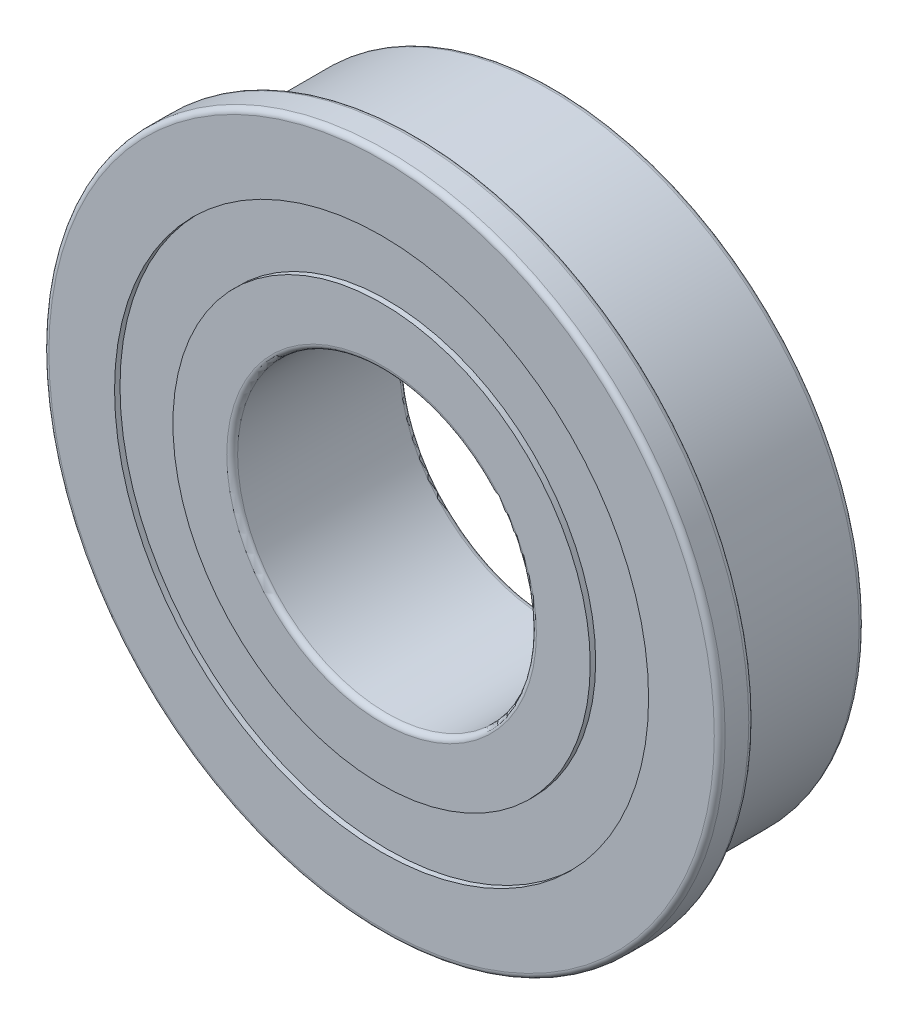
ISO-10303-21;
HEADER;
FILE_DESCRIPTION(('STEP AP214'),'2;1');
FILE_NAME('part.step','',(''),(''),'','','');
FILE_SCHEMA(('AUTOMOTIVE_DESIGN { 1 0 10303 214 1 1 1 1 }'));
ENDSEC;
DATA;
#1=APPLICATION_CONTEXT('core data for automotive mechanical design processes');
#2=APPLICATION_PROTOCOL_DEFINITION('international standard','automotive_design',2000,#1);
#3=PRODUCT_CONTEXT('',#1,'mechanical');
#4=PRODUCT('Part','Part','',(#3));
#5=PRODUCT_RELATED_PRODUCT_CATEGORY('part','',(#4));
#6=PRODUCT_DEFINITION_FORMATION('','',#4);
#7=PRODUCT_DEFINITION_CONTEXT('part definition',#1,'design');
#8=PRODUCT_DEFINITION('design','',#6,#7);
#9=PRODUCT_DEFINITION_SHAPE('','',#8);
#10=(LENGTH_UNIT() NAMED_UNIT(*) SI_UNIT(.MILLI.,.METRE.));
#11=(NAMED_UNIT(*) PLANE_ANGLE_UNIT() SI_UNIT($,.RADIAN.));
#12=(NAMED_UNIT(*) SI_UNIT($,.STERADIAN.) SOLID_ANGLE_UNIT());
#13=UNCERTAINTY_MEASURE_WITH_UNIT(LENGTH_MEASURE(1.E-05),#10,'distance_accuracy_value','');
#14=(GEOMETRIC_REPRESENTATION_CONTEXT(3) GLOBAL_UNCERTAINTY_ASSIGNED_CONTEXT((#13)) GLOBAL_UNIT_ASSIGNED_CONTEXT((#10,
#11,#12)) REPRESENTATION_CONTEXT('',''));
#15=CARTESIAN_POINT('',(0.,0.,0.));
#16=DIRECTION('',(0.,0.,1.));
#17=DIRECTION('',(1.,0.,0.));
#18=AXIS2_PLACEMENT_3D('',#15,#16,#17);
#19=CARTESIAN_POINT('',(0.,0.,53.2489151398073));
#20=DIRECTION('',(0.,0.,1.));
#21=DIRECTION('',(1.,0.,0.));
#22=AXIS2_PLACEMENT_3D('',#19,#20,#21);
#23=CYLINDRICAL_SURFACE('',#22,12.2875);
#24=CARTESIAN_POINT('',(0.,0.,-3.96875));
#25=DIRECTION('',(0.,0.,1.));
#26=DIRECTION('',(1.,0.,0.));
#27=AXIS2_PLACEMENT_3D('',#24,#25,#26);
#28=CIRCLE('',#27,12.2875);
#29=CARTESIAN_POINT('',(12.2875,0.,-3.96875));
#30=VERTEX_POINT('',#29);
#31=EDGE_CURVE('E405',#30,#30,#28,.F.);
#32=ORIENTED_EDGE('',*,*,#31,.T.);
#33=EDGE_LOOP('',(#32));
#34=FACE_BOUND('',#33,.T.);
#35=CARTESIAN_POINT('',(0.,0.,-3.71875));
#36=DIRECTION('',(0.,0.,1.));
#37=DIRECTION('',(1.,0.,0.));
#38=AXIS2_PLACEMENT_3D('',#35,#36,#37);
#39=CIRCLE('',#38,12.2875);
#40=CARTESIAN_POINT('',(12.2875,0.,-3.71875));
#41=VERTEX_POINT('',#40);
#42=EDGE_CURVE('E78',#41,#41,#39,.T.);
#43=ORIENTED_EDGE('',*,*,#42,.T.);
#44=EDGE_LOOP('',(#43));
#45=FACE_BOUND('',#44,.T.);
#46=ADVANCED_FACE('F15',(#34,#45),#23,.F.);
#47=CARTESIAN_POINT('',(0.,12.2875,-3.96875));
#48=DIRECTION('',(0.,0.,1.));
#49=DIRECTION('',(1.,0.,0.));
#50=AXIS2_PLACEMENT_3D('',#47,#48,#49);
#51=PLANE('',#50);
#52=ORIENTED_EDGE('',*,*,#31,.F.);
#53=EDGE_LOOP('',(#52));
#54=FACE_BOUND('',#53,.T.);
#55=CARTESIAN_POINT('',(0.,0.,-3.96875));
#56=DIRECTION('',(0.,0.,1.));
#57=DIRECTION('',(1.,0.,0.));
#58=AXIS2_PLACEMENT_3D('',#55,#56,#57);
#59=CIRCLE('',#58,14.0375);
#60=CARTESIAN_POINT('',(14.0375,0.,-3.96875));
#61=VERTEX_POINT('',#60);
#62=CARTESIAN_POINT('',(-14.0375,0.,-3.96875));
#63=VERTEX_POINT('',#62);
#64=EDGE_CURVE('E68',#61,#63,#59,.T.);
#65=ORIENTED_EDGE('',*,*,#64,.F.);
#66=CARTESIAN_POINT('',(0.,0.,-3.96875));
#67=DIRECTION('',(0.,0.,1.));
#68=DIRECTION('',(-1.,0.,0.));
#69=AXIS2_PLACEMENT_3D('',#66,#67,#68);
#70=CIRCLE('',#69,14.0375);
#71=EDGE_CURVE('E66',#63,#61,#70,.T.);
#72=ORIENTED_EDGE('',*,*,#71,.F.);
#73=EDGE_LOOP('',(#65,#72));
#74=FACE_BOUND('',#73,.T.);
#75=ADVANCED_FACE('F77',(#54,#74),#51,.F.);
#76=CARTESIAN_POINT('',(0.,9.602,-3.71875));
#77=DIRECTION('',(0.,0.,1.));
#78=DIRECTION('',(1.,0.,0.));
#79=AXIS2_PLACEMENT_3D('',#76,#77,#78);
#80=PLANE('',#79);
#81=CARTESIAN_POINT('',(0.,0.,-3.71875));
#82=DIRECTION('',(0.,0.,1.));
#83=DIRECTION('',(1.,0.,0.));
#84=AXIS2_PLACEMENT_3D('',#81,#82,#83);
#85=CIRCLE('',#84,9.602);
#86=CARTESIAN_POINT('',(9.602,0.,-3.71875));
#87=VERTEX_POINT('',#86);
#88=EDGE_CURVE('E73',#87,#87,#85,.F.);
#89=ORIENTED_EDGE('',*,*,#88,.F.);
#90=EDGE_LOOP('',(#89));
#91=FACE_BOUND('',#90,.T.);
#92=ORIENTED_EDGE('',*,*,#42,.F.);
#93=EDGE_LOOP('',(#92));
#94=FACE_BOUND('',#93,.T.);
#95=ADVANCED_FACE('F92',(#91,#94),#80,.F.);
#96=CARTESIAN_POINT('',(0.,0.,-3.71875));
#97=DIRECTION('',(0.,0.,1.));
#98=DIRECTION('',(1.,0.,0.));
#99=AXIS2_PLACEMENT_3D('',#96,#97,#98);
#100=TOROIDAL_SURFACE('',#99,14.0375,0.25);
#101=CARTESIAN_POINT('',(0.,0.,-3.71875));
#102=DIRECTION('',(0.,0.,1.));
#103=DIRECTION('',(1.,0.,0.));
#104=AXIS2_PLACEMENT_3D('',#101,#102,#103);
#105=CIRCLE('',#104,14.2875);
#106=CARTESIAN_POINT('',(14.2875,0.,-3.71875));
#107=VERTEX_POINT('',#106);
#108=EDGE_CURVE('E107',#107,#107,#105,.T.);
#109=ORIENTED_EDGE('',*,*,#108,.F.);
#110=EDGE_LOOP('',(#109));
#111=FACE_BOUND('',#110,.T.);
#112=ORIENTED_EDGE('',*,*,#64,.T.);
#113=ORIENTED_EDGE('',*,*,#71,.T.);
#114=EDGE_LOOP('',(#112,#113));
#115=FACE_BOUND('',#114,.T.);
#116=ADVANCED_FACE('F70',(#111,#115),#100,.T.);
#117=CARTESIAN_POINT('',(0.,0.,53.2489151398073));
#118=DIRECTION('',(0.,0.,1.));
#119=DIRECTION('',(1.,0.,0.));
#120=AXIS2_PLACEMENT_3D('',#117,#118,#119);
#121=CYLINDRICAL_SURFACE('',#120,9.602);
#122=ORIENTED_EDGE('',*,*,#88,.T.);
#123=EDGE_LOOP('',(#122));
#124=FACE_BOUND('',#123,.T.);
#125=CARTESIAN_POINT('',(0.,0.,-3.96875));
#126=DIRECTION('',(0.,0.,1.));
#127=DIRECTION('',(1.,0.,0.));
#128=AXIS2_PLACEMENT_3D('',#125,#126,#127);
#129=CIRCLE('',#128,9.602);
#130=CARTESIAN_POINT('',(9.602,0.,-3.96875));
#131=VERTEX_POINT('',#130);
#132=EDGE_CURVE('E110',#131,#131,#129,.T.);
#133=ORIENTED_EDGE('',*,*,#132,.T.);
#134=EDGE_LOOP('',(#133));
#135=FACE_BOUND('',#134,.T.);
#136=ADVANCED_FACE('F101',(#124,#135),#121,.T.);
#137=CARTESIAN_POINT('',(0.,0.,53.2489151398073));
#138=DIRECTION('',(0.,0.,1.));
#139=DIRECTION('',(1.,0.,0.));
#140=AXIS2_PLACEMENT_3D('',#137,#138,#139);
#141=CYLINDRICAL_SURFACE('',#140,14.2875);
#142=CARTESIAN_POINT('',(0.,0.,1.63125));
#143=DIRECTION('',(0.,0.,-1.));
#144=DIRECTION('',(-1.,0.,0.));
#145=AXIS2_PLACEMENT_3D('',#142,#143,#144);
#146=CIRCLE('',#145,14.2875);
#147=CARTESIAN_POINT('',(-14.2875,0.,1.63125));
#148=VERTEX_POINT('',#147);
#149=EDGE_CURVE('E111',#148,#148,#146,.F.);
#150=ORIENTED_EDGE('',*,*,#149,.F.);
#151=EDGE_LOOP('',(#150));
#152=FACE_BOUND('',#151,.T.);
#153=ORIENTED_EDGE('',*,*,#108,.T.);
#154=EDGE_LOOP('',(#153));
#155=FACE_BOUND('',#154,.T.);
#156=ADVANCED_FACE('F161',(#152,#155),#141,.T.);
#157=CARTESIAN_POINT('',(0.,6.875,-3.96875));
#158=DIRECTION('',(0.,0.,1.));
#159=DIRECTION('',(1.,0.,0.));
#160=AXIS2_PLACEMENT_3D('',#157,#158,#159);
#161=PLANE('',#160);
#162=ORIENTED_EDGE('',*,*,#132,.F.);
#163=EDGE_LOOP('',(#162));
#164=FACE_BOUND('',#163,.T.);
#165=CARTESIAN_POINT('',(0.,0.,-3.96875));
#166=DIRECTION('',(0.,0.,-1.));
#167=DIRECTION('',(1.,0.,0.));
#168=AXIS2_PLACEMENT_3D('',#165,#166,#167);
#169=CIRCLE('',#168,7.125);
#170=CARTESIAN_POINT('',(7.125,0.,-3.96875));
#171=VERTEX_POINT('',#170);
#172=CARTESIAN_POINT('',(-7.125,0.,-3.96875));
#173=VERTEX_POINT('',#172);
#174=EDGE_CURVE('E114',#171,#173,#169,.T.);
#175=ORIENTED_EDGE('',*,*,#174,.F.);
#176=CARTESIAN_POINT('',(0.,0.,-3.96875));
#177=DIRECTION('',(0.,0.,-1.));
#178=DIRECTION('',(-1.,0.,0.));
#179=AXIS2_PLACEMENT_3D('',#176,#177,#178);
#180=CIRCLE('',#179,7.125);
#181=EDGE_CURVE('E145',#173,#171,#180,.T.);
#182=ORIENTED_EDGE('',*,*,#181,.F.);
#183=EDGE_LOOP('',(#175,#182));
#184=FACE_BOUND('',#183,.T.);
#185=ADVANCED_FACE('F153',(#164,#184),#161,.F.);
#186=CARTESIAN_POINT('',(0.,0.,1.63125));
#187=DIRECTION('',(0.,0.,-1.));
#188=DIRECTION('',(-1.,0.,0.));
#189=AXIS2_PLACEMENT_3D('',#186,#187,#188);
#190=CONICAL_SURFACE('',#189,14.2875,0.523598775598298);
#191=ORIENTED_EDGE('',*,*,#149,.T.);
#192=EDGE_LOOP('',(#191));
#193=FACE_BOUND('',#192,.T.);
#194=CARTESIAN_POINT('',(0.,0.,2.00625));
#195=DIRECTION('',(0.,0.,1.));
#196=DIRECTION('',(1.,0.,0.));
#197=AXIS2_PLACEMENT_3D('',#194,#195,#196);
#198=CIRCLE('',#197,14.0709936490539);
#199=CARTESIAN_POINT('',(14.0709936490539,0.,2.00625));
#200=VERTEX_POINT('',#199);
#201=EDGE_CURVE('E142',#200,#200,#198,.F.);
#202=ORIENTED_EDGE('',*,*,#201,.T.);
#203=EDGE_LOOP('',(#202));
#204=FACE_BOUND('',#203,.T.);
#205=ADVANCED_FACE('F132',(#193,#204),#190,.T.);
#206=CARTESIAN_POINT('',(0.,0.,-3.71875));
#207=DIRECTION('',(0.,0.,1.));
#208=DIRECTION('',(1.,0.,0.));
#209=AXIS2_PLACEMENT_3D('',#206,#207,#208);
#210=TOROIDAL_SURFACE('',#209,7.125,0.25);
#211=ORIENTED_EDGE('',*,*,#174,.T.);
#212=ORIENTED_EDGE('',*,*,#181,.T.);
#213=EDGE_LOOP('',(#211,#212));
#214=FACE_BOUND('',#213,.T.);
#215=CARTESIAN_POINT('',(0.,0.,-3.71875));
#216=DIRECTION('',(0.,0.,1.));
#217=DIRECTION('',(1.,0.,0.));
#218=AXIS2_PLACEMENT_3D('',#215,#216,#217);
#219=CIRCLE('',#218,6.875);
#220=CARTESIAN_POINT('',(6.875,0.,-3.71875));
#221=VERTEX_POINT('',#220);
#222=EDGE_CURVE('E140',#221,#221,#219,.T.);
#223=ORIENTED_EDGE('',*,*,#222,.T.);
#224=EDGE_LOOP('',(#223));
#225=FACE_BOUND('',#224,.T.);
#226=ADVANCED_FACE('F120',(#214,#225),#210,.T.);
#227=CARTESIAN_POINT('',(0.,0.,53.2489151398073));
#228=DIRECTION('',(0.,0.,1.));
#229=DIRECTION('',(1.,0.,0.));
#230=AXIS2_PLACEMENT_3D('',#227,#228,#229);
#231=CYLINDRICAL_SURFACE('',#230,6.875);
#232=ORIENTED_EDGE('',*,*,#222,.F.);
#233=EDGE_LOOP('',(#232));
#234=FACE_BOUND('',#233,.T.);
#235=CARTESIAN_POINT('',(0.,0.,3.71875));
#236=DIRECTION('',(0.,0.,-1.));
#237=DIRECTION('',(-1.,0.,0.));
#238=AXIS2_PLACEMENT_3D('',#235,#236,#237);
#239=CIRCLE('',#238,6.875);
#240=CARTESIAN_POINT('',(-6.875,0.,3.71875));
#241=VERTEX_POINT('',#240);
#242=EDGE_CURVE('E384',#241,#241,#239,.T.);
#243=ORIENTED_EDGE('',*,*,#242,.F.);
#244=EDGE_LOOP('',(#243));
#245=FACE_BOUND('',#244,.T.);
#246=ADVANCED_FACE('F131',(#234,#245),#231,.F.);
#247=CARTESIAN_POINT('',(0.,0.,2.13125));
#248=DIRECTION('',(0.,0.,1.));
#249=DIRECTION('',(1.,0.,0.));
#250=AXIS2_PLACEMENT_3D('',#247,#248,#249);
#251=TOROIDAL_SURFACE('',#250,14.2875,0.249999999999998);
#252=ORIENTED_EDGE('',*,*,#201,.F.);
#253=EDGE_LOOP('',(#252));
#254=FACE_BOUND('',#253,.T.);
#255=CARTESIAN_POINT('',(0.,0.,2.38125));
#256=DIRECTION('',(0.,0.,-1.));
#257=DIRECTION('',(1.,0.,0.));
#258=AXIS2_PLACEMENT_3D('',#255,#256,#257);
#259=CIRCLE('',#258,14.2875);
#260=CARTESIAN_POINT('',(14.2875,0.,2.38125));
#261=VERTEX_POINT('',#260);
#262=CARTESIAN_POINT('',(-14.2875,0.,2.38125));
#263=VERTEX_POINT('',#262);
#264=EDGE_CURVE('E386',#261,#263,#259,.T.);
#265=ORIENTED_EDGE('',*,*,#264,.T.);
#266=CARTESIAN_POINT('',(0.,0.,2.38125));
#267=DIRECTION('',(0.,0.,-1.));
#268=DIRECTION('',(-1.,0.,0.));
#269=AXIS2_PLACEMENT_3D('',#266,#267,#268);
#270=CIRCLE('',#269,14.2875);
#271=EDGE_CURVE('E322',#263,#261,#270,.T.);
#272=ORIENTED_EDGE('',*,*,#271,.T.);
#273=EDGE_LOOP('',(#265,#272));
#274=FACE_BOUND('',#273,.T.);
#275=ADVANCED_FACE('F355',(#254,#274),#251,.F.);
#276=CARTESIAN_POINT('',(0.,0.,3.71875));
#277=DIRECTION('',(0.,0.,-1.));
#278=DIRECTION('',(-1.,0.,0.));
#279=AXIS2_PLACEMENT_3D('',#276,#277,#278);
#280=TOROIDAL_SURFACE('',#279,7.125,0.25);
#281=CARTESIAN_POINT('',(0.,0.,3.96875));
#282=DIRECTION('',(0.,0.,1.));
#283=DIRECTION('',(-1.,0.,0.));
#284=AXIS2_PLACEMENT_3D('',#281,#282,#283);
#285=CIRCLE('',#284,7.125);
#286=CARTESIAN_POINT('',(-7.125,0.,3.96875));
#287=VERTEX_POINT('',#286);
#288=CARTESIAN_POINT('',(7.125,0.,3.96875));
#289=VERTEX_POINT('',#288);
#290=EDGE_CURVE('E266',#287,#289,#285,.T.);
#291=ORIENTED_EDGE('',*,*,#290,.T.);
#292=CARTESIAN_POINT('',(0.,0.,3.96875));
#293=DIRECTION('',(0.,0.,1.));
#294=DIRECTION('',(1.,0.,0.));
#295=AXIS2_PLACEMENT_3D('',#292,#293,#294);
#296=CIRCLE('',#295,7.125);
#297=EDGE_CURVE('E277',#289,#287,#296,.T.);
#298=ORIENTED_EDGE('',*,*,#297,.T.);
#299=EDGE_LOOP('',(#291,#298));
#300=FACE_BOUND('',#299,.T.);
#301=ORIENTED_EDGE('',*,*,#242,.T.);
#302=EDGE_LOOP('',(#301));
#303=FACE_BOUND('',#302,.T.);
#304=ADVANCED_FACE('F301',(#300,#303),#280,.T.);
#305=CARTESIAN_POINT('',(0.,14.2875,2.38125));
#306=DIRECTION('',(0.,0.,1.));
#307=DIRECTION('',(1.,0.,0.));
#308=AXIS2_PLACEMENT_3D('',#305,#306,#307);
#309=PLANE('',#308);
#310=ORIENTED_EDGE('',*,*,#264,.F.);
#311=ORIENTED_EDGE('',*,*,#271,.F.);
#312=EDGE_LOOP('',(#310,#311));
#313=FACE_BOUND('',#312,.T.);
#314=CARTESIAN_POINT('',(0.,0.,2.38125));
#315=DIRECTION('',(0.,0.,1.));
#316=DIRECTION('',(1.,0.,0.));
#317=AXIS2_PLACEMENT_3D('',#314,#315,#316);
#318=CIRCLE('',#317,15.31);
#319=CARTESIAN_POINT('',(15.31,0.,2.38125));
#320=VERTEX_POINT('',#319);
#321=CARTESIAN_POINT('',(-15.31,0.,2.38125));
#322=VERTEX_POINT('',#321);
#323=EDGE_CURVE('E235',#320,#322,#318,.T.);
#324=ORIENTED_EDGE('',*,*,#323,.F.);
#325=CARTESIAN_POINT('',(0.,0.,2.38125));
#326=DIRECTION('',(0.,0.,1.));
#327=DIRECTION('',(-1.,0.,0.));
#328=AXIS2_PLACEMENT_3D('',#325,#326,#327);
#329=CIRCLE('',#328,15.31);
#330=EDGE_CURVE('E332',#322,#320,#329,.T.);
#331=ORIENTED_EDGE('',*,*,#330,.F.);
#332=EDGE_LOOP('',(#324,#331));
#333=FACE_BOUND('',#332,.T.);
#334=ADVANCED_FACE('F292',(#313,#333),#309,.F.);
#335=CARTESIAN_POINT('',(0.,9.602,3.96875));
#336=DIRECTION('',(0.,0.,-1.));
#337=DIRECTION('',(-1.,0.,0.));
#338=AXIS2_PLACEMENT_3D('',#335,#336,#337);
#339=PLANE('',#338);
#340=CARTESIAN_POINT('',(0.,0.,3.96875));
#341=DIRECTION('',(0.,0.,1.));
#342=DIRECTION('',(1.,0.,0.));
#343=AXIS2_PLACEMENT_3D('',#340,#341,#342);
#344=CIRCLE('',#343,9.602);
#345=CARTESIAN_POINT('',(9.602,0.,3.96875));
#346=VERTEX_POINT('',#345);
#347=EDGE_CURVE('E390',#346,#346,#344,.F.);
#348=ORIENTED_EDGE('',*,*,#347,.F.);
#349=EDGE_LOOP('',(#348));
#350=FACE_BOUND('',#349,.T.);
#351=ORIENTED_EDGE('',*,*,#290,.F.);
#352=ORIENTED_EDGE('',*,*,#297,.F.);
#353=EDGE_LOOP('',(#351,#352));
#354=FACE_BOUND('',#353,.T.);
#355=ADVANCED_FACE('F255',(#350,#354),#339,.F.);
#356=CARTESIAN_POINT('',(0.,0.,2.63125));
#357=DIRECTION('',(0.,0.,1.));
#358=DIRECTION('',(1.,0.,0.));
#359=AXIS2_PLACEMENT_3D('',#356,#357,#358);
#360=TOROIDAL_SURFACE('',#359,15.31,0.25);
#361=ORIENTED_EDGE('',*,*,#323,.T.);
#362=ORIENTED_EDGE('',*,*,#330,.T.);
#363=EDGE_LOOP('',(#361,#362));
#364=FACE_BOUND('',#363,.T.);
#365=CARTESIAN_POINT('',(0.,0.,2.63125));
#366=DIRECTION('',(0.,0.,1.));
#367=DIRECTION('',(1.,0.,0.));
#368=AXIS2_PLACEMENT_3D('',#365,#366,#367);
#369=CIRCLE('',#368,15.56);
#370=CARTESIAN_POINT('',(15.56,0.,2.63125));
#371=VERTEX_POINT('',#370);
#372=EDGE_CURVE('E263',#371,#371,#369,.T.);
#373=ORIENTED_EDGE('',*,*,#372,.F.);
#374=EDGE_LOOP('',(#373));
#375=FACE_BOUND('',#374,.T.);
#376=ADVANCED_FACE('F243',(#364,#375),#360,.T.);
#377=CARTESIAN_POINT('',(0.,0.,53.2489151398073));
#378=DIRECTION('',(0.,0.,1.));
#379=DIRECTION('',(1.,0.,0.));
#380=AXIS2_PLACEMENT_3D('',#377,#378,#379);
#381=CYLINDRICAL_SURFACE('',#380,9.602);
#382=ORIENTED_EDGE('',*,*,#347,.T.);
#383=EDGE_LOOP('',(#382));
#384=FACE_BOUND('',#383,.T.);
#385=CARTESIAN_POINT('',(0.,0.,3.71875));
#386=DIRECTION('',(0.,0.,1.));
#387=DIRECTION('',(1.,0.,0.));
#388=AXIS2_PLACEMENT_3D('',#385,#386,#387);
#389=CIRCLE('',#388,9.602);
#390=CARTESIAN_POINT('',(9.602,0.,3.71875));
#391=VERTEX_POINT('',#390);
#392=EDGE_CURVE('E396',#391,#391,#389,.T.);
#393=ORIENTED_EDGE('',*,*,#392,.T.);
#394=EDGE_LOOP('',(#393));
#395=FACE_BOUND('',#394,.T.);
#396=ADVANCED_FACE('F254',(#384,#395),#381,.T.);
#397=CARTESIAN_POINT('',(0.,0.,53.2489151398073));
#398=DIRECTION('',(0.,0.,1.));
#399=DIRECTION('',(1.,0.,0.));
#400=AXIS2_PLACEMENT_3D('',#397,#398,#399);
#401=CYLINDRICAL_SURFACE('',#400,15.56);
#402=ORIENTED_EDGE('',*,*,#372,.T.);
#403=EDGE_LOOP('',(#402));
#404=FACE_BOUND('',#403,.T.);
#405=CARTESIAN_POINT('',(0.,0.,3.71875));
#406=DIRECTION('',(0.,0.,-1.));
#407=DIRECTION('',(-1.,0.,0.));
#408=AXIS2_PLACEMENT_3D('',#405,#406,#407);
#409=CIRCLE('',#408,15.56);
#410=CARTESIAN_POINT('',(-15.56,0.,3.71875));
#411=VERTEX_POINT('',#410);
#412=EDGE_CURVE('E598',#411,#411,#409,.F.);
#413=ORIENTED_EDGE('',*,*,#412,.F.);
#414=EDGE_LOOP('',(#413));
#415=FACE_BOUND('',#414,.T.);
#416=ADVANCED_FACE('F513',(#404,#415),#401,.T.);
#417=CARTESIAN_POINT('',(0.,12.2875,3.71875));
#418=DIRECTION('',(0.,0.,-1.));
#419=DIRECTION('',(-1.,0.,0.));
#420=AXIS2_PLACEMENT_3D('',#417,#418,#419);
#421=PLANE('',#420);
#422=CARTESIAN_POINT('',(0.,0.,3.71875));
#423=DIRECTION('',(0.,0.,1.));
#424=DIRECTION('',(1.,0.,0.));
#425=AXIS2_PLACEMENT_3D('',#422,#423,#424);
#426=CIRCLE('',#425,12.2875);
#427=CARTESIAN_POINT('',(12.2875,0.,3.71875));
#428=VERTEX_POINT('',#427);
#429=EDGE_CURVE('E594',#428,#428,#426,.T.);
#430=ORIENTED_EDGE('',*,*,#429,.T.);
#431=EDGE_LOOP('',(#430));
#432=FACE_BOUND('',#431,.T.);
#433=ORIENTED_EDGE('',*,*,#392,.F.);
#434=EDGE_LOOP('',(#433));
#435=FACE_BOUND('',#434,.T.);
#436=ADVANCED_FACE('F214',(#432,#435),#421,.F.);
#437=CARTESIAN_POINT('',(0.,0.,3.71875));
#438=DIRECTION('',(0.,0.,-1.));
#439=DIRECTION('',(-1.,0.,0.));
#440=AXIS2_PLACEMENT_3D('',#437,#438,#439);
#441=TOROIDAL_SURFACE('',#440,15.31,0.25);
#442=CARTESIAN_POINT('',(0.,0.,3.96875));
#443=DIRECTION('',(0.,0.,-1.));
#444=DIRECTION('',(-1.,0.,0.));
#445=AXIS2_PLACEMENT_3D('',#442,#443,#444);
#446=CIRCLE('',#445,15.31);
#447=CARTESIAN_POINT('',(-15.31,0.,3.96875));
#448=VERTEX_POINT('',#447);
#449=CARTESIAN_POINT('',(15.31,0.,3.96875));
#450=VERTEX_POINT('',#449);
#451=EDGE_CURVE('E602',#448,#450,#446,.T.);
#452=ORIENTED_EDGE('',*,*,#451,.T.);
#453=CARTESIAN_POINT('',(0.,0.,3.96875));
#454=DIRECTION('',(0.,0.,-1.));
#455=DIRECTION('',(1.,0.,0.));
#456=AXIS2_PLACEMENT_3D('',#453,#454,#455);
#457=CIRCLE('',#456,15.31);
#458=EDGE_CURVE('E26',#450,#448,#457,.T.);
#459=ORIENTED_EDGE('',*,*,#458,.T.);
#460=EDGE_LOOP('',(#452,#459));
#461=FACE_BOUND('',#460,.T.);
#462=ORIENTED_EDGE('',*,*,#412,.T.);
#463=EDGE_LOOP('',(#462));
#464=FACE_BOUND('',#463,.T.);
#465=ADVANCED_FACE('F188',(#461,#464),#441,.T.);
#466=CARTESIAN_POINT('',(0.,0.,53.2489151398073));
#467=DIRECTION('',(0.,0.,1.));
#468=DIRECTION('',(1.,0.,0.));
#469=AXIS2_PLACEMENT_3D('',#466,#467,#468);
#470=CYLINDRICAL_SURFACE('',#469,12.2875);
#471=ORIENTED_EDGE('',*,*,#429,.F.);
#472=EDGE_LOOP('',(#471));
#473=FACE_BOUND('',#472,.T.);
#474=CARTESIAN_POINT('',(0.,0.,3.96875));
#475=DIRECTION('',(0.,0.,1.));
#476=DIRECTION('',(1.,0.,0.));
#477=AXIS2_PLACEMENT_3D('',#474,#475,#476);
#478=CIRCLE('',#477,12.2875);
#479=CARTESIAN_POINT('',(12.2875,0.,3.96875));
#480=VERTEX_POINT('',#479);
#481=EDGE_CURVE('E10',#480,#480,#478,.T.);
#482=ORIENTED_EDGE('',*,*,#481,.T.);
#483=EDGE_LOOP('',(#482));
#484=FACE_BOUND('',#483,.T.);
#485=ADVANCED_FACE('F182',(#473,#484),#470,.F.);
#486=CARTESIAN_POINT('',(0.,15.56,3.96875));
#487=DIRECTION('',(0.,0.,-1.));
#488=DIRECTION('',(-1.,0.,0.));
#489=AXIS2_PLACEMENT_3D('',#486,#487,#488);
#490=PLANE('',#489);
#491=ORIENTED_EDGE('',*,*,#481,.F.);
#492=EDGE_LOOP('',(#491));
#493=FACE_BOUND('',#492,.T.);
#494=ORIENTED_EDGE('',*,*,#451,.F.);
#495=ORIENTED_EDGE('',*,*,#458,.F.);
#496=EDGE_LOOP('',(#494,#495));
#497=FACE_BOUND('',#496,.T.);
#498=ADVANCED_FACE('F180',(#493,#497),#490,.F.);
#499=CLOSED_SHELL('',(#46,#75,#95,#116,#136,#156,#185,#205,#226,#246,#275,#304,#334,#355,#376,
#396,#416,#436,#465,#485,#498));
#500=MANIFOLD_SOLID_BREP('B1',#499);
#501=ADVANCED_BREP_SHAPE_REPRESENTATION('',(#18,#500),#14);
#502=SHAPE_DEFINITION_REPRESENTATION(#9,#501);
ENDSEC;
END-ISO-10303-21;
